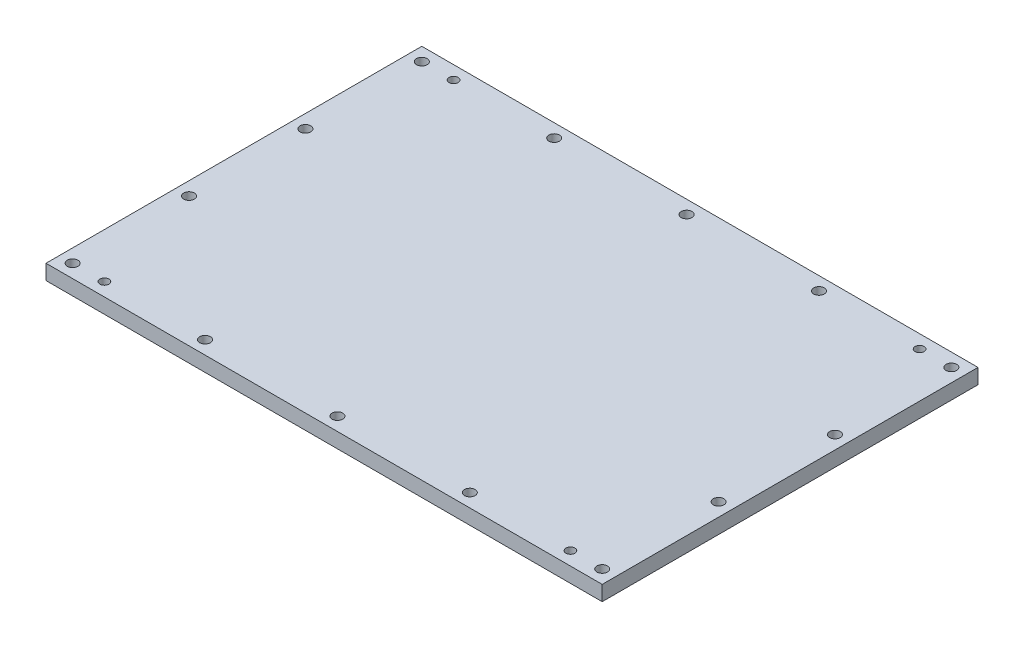
ISO-10303-21;
HEADER;
FILE_DESCRIPTION(('STEP AP214'),'2;1');
FILE_NAME('part.step','',(''),(''),'','','');
FILE_SCHEMA(('AUTOMOTIVE_DESIGN { 1 0 10303 214 1 1 1 1 }'));
ENDSEC;
DATA;
#1=APPLICATION_CONTEXT('core data for automotive mechanical design processes');
#2=APPLICATION_PROTOCOL_DEFINITION('international standard','automotive_design',2000,#1);
#3=PRODUCT_CONTEXT('',#1,'mechanical');
#4=PRODUCT('Part','Part','',(#3));
#5=PRODUCT_RELATED_PRODUCT_CATEGORY('part','',(#4));
#6=PRODUCT_DEFINITION_FORMATION('','',#4);
#7=PRODUCT_DEFINITION_CONTEXT('part definition',#1,'design');
#8=PRODUCT_DEFINITION('design','',#6,#7);
#9=PRODUCT_DEFINITION_SHAPE('','',#8);
#10=(LENGTH_UNIT() NAMED_UNIT(*) SI_UNIT(.MILLI.,.METRE.));
#11=(NAMED_UNIT(*) PLANE_ANGLE_UNIT() SI_UNIT($,.RADIAN.));
#12=(NAMED_UNIT(*) SI_UNIT($,.STERADIAN.) SOLID_ANGLE_UNIT());
#13=UNCERTAINTY_MEASURE_WITH_UNIT(LENGTH_MEASURE(1.E-05),#10,'distance_accuracy_value','');
#14=(GEOMETRIC_REPRESENTATION_CONTEXT(3) GLOBAL_UNCERTAINTY_ASSIGNED_CONTEXT((#13)) GLOBAL_UNIT_ASSIGNED_CONTEXT((#10,
#11,#12)) REPRESENTATION_CONTEXT('',''));
#15=CARTESIAN_POINT('',(0.,0.,0.));
#16=DIRECTION('',(0.,0.,1.));
#17=DIRECTION('',(1.,0.,0.));
#18=AXIS2_PLACEMENT_3D('',#15,#16,#17);
#19=CARTESIAN_POINT('',(-117.475,6.35,-79.375));
#20=DIRECTION('',(1.,0.,0.));
#21=DIRECTION('',(0.,0.,-1.));
#22=AXIS2_PLACEMENT_3D('',#19,#20,#21);
#23=PLANE('',#22);
#24=DIRECTION('',(0.,0.,1.));
#25=VECTOR('',#24,1.);
#26=CARTESIAN_POINT('',(-117.475,0.,-79.375));
#27=LINE('',#26,#25);
#28=CARTESIAN_POINT('',(-117.475,0.,-79.375));
#29=VERTEX_POINT('',#28);
#30=CARTESIAN_POINT('',(-117.475,0.,79.375));
#31=VERTEX_POINT('',#30);
#32=EDGE_CURVE('E98',#29,#31,#27,.T.);
#33=ORIENTED_EDGE('',*,*,#32,.T.);
#34=DIRECTION('',(0.,-1.,0.));
#35=VECTOR('',#34,1.);
#36=CARTESIAN_POINT('',(-117.475,6.35,79.375));
#37=LINE('',#36,#35);
#38=CARTESIAN_POINT('',(-117.475,6.35,79.375));
#39=VERTEX_POINT('',#38);
#40=EDGE_CURVE('E11',#39,#31,#37,.T.);
#41=ORIENTED_EDGE('',*,*,#40,.F.);
#42=DIRECTION('',(0.,0.,1.));
#43=VECTOR('',#42,1.);
#44=CARTESIAN_POINT('',(-117.475,6.35,-79.375));
#45=LINE('',#44,#43);
#46=CARTESIAN_POINT('',(-117.475,6.35,-79.375));
#47=VERTEX_POINT('',#46);
#48=EDGE_CURVE('E86',#47,#39,#45,.T.);
#49=ORIENTED_EDGE('',*,*,#48,.F.);
#50=DIRECTION('',(0.,-1.,0.));
#51=VECTOR('',#50,1.);
#52=CARTESIAN_POINT('',(-117.475,6.35,-79.375));
#53=LINE('',#52,#51);
#54=EDGE_CURVE('E94',#47,#29,#53,.T.);
#55=ORIENTED_EDGE('',*,*,#54,.T.);
#56=EDGE_LOOP('',(#33,#41,#49,#55));
#57=FACE_BOUND('',#56,.T.);
#58=ADVANCED_FACE('F35',(#57),#23,.F.);
#59=CARTESIAN_POINT('',(-117.475,6.35,79.375));
#60=DIRECTION('',(0.,0.,-1.));
#61=DIRECTION('',(-1.,0.,0.));
#62=AXIS2_PLACEMENT_3D('',#59,#60,#61);
#63=PLANE('',#62);
#64=DIRECTION('',(1.,0.,0.));
#65=VECTOR('',#64,1.);
#66=CARTESIAN_POINT('',(-117.475,0.,79.375));
#67=LINE('',#66,#65);
#68=CARTESIAN_POINT('',(117.475,0.,79.375));
#69=VERTEX_POINT('',#68);
#70=EDGE_CURVE('E90',#31,#69,#67,.T.);
#71=ORIENTED_EDGE('',*,*,#70,.T.);
#72=DIRECTION('',(0.,-1.,0.));
#73=VECTOR('',#72,1.);
#74=CARTESIAN_POINT('',(117.475,6.35,79.375));
#75=LINE('',#74,#73);
#76=CARTESIAN_POINT('',(117.475,6.35,79.375));
#77=VERTEX_POINT('',#76);
#78=EDGE_CURVE('E43',#77,#69,#75,.T.);
#79=ORIENTED_EDGE('',*,*,#78,.F.);
#80=DIRECTION('',(1.,0.,0.));
#81=VECTOR('',#80,1.);
#82=CARTESIAN_POINT('',(-117.475,6.35,79.375));
#83=LINE('',#82,#81);
#84=EDGE_CURVE('E81',#39,#77,#83,.T.);
#85=ORIENTED_EDGE('',*,*,#84,.F.);
#86=ORIENTED_EDGE('',*,*,#40,.T.);
#87=EDGE_LOOP('',(#71,#79,#85,#86));
#88=FACE_BOUND('',#87,.T.);
#89=ADVANCED_FACE('F89',(#88),#63,.F.);
#90=CARTESIAN_POINT('',(117.475,6.35,-79.375));
#91=DIRECTION('',(-1.,0.,0.));
#92=DIRECTION('',(0.,0.,1.));
#93=AXIS2_PLACEMENT_3D('',#90,#91,#92);
#94=PLANE('',#93);
#95=DIRECTION('',(0.,0.,-1.));
#96=VECTOR('',#95,1.);
#97=CARTESIAN_POINT('',(117.475,0.,-79.375));
#98=LINE('',#97,#96);
#99=CARTESIAN_POINT('',(117.475,0.,-79.375));
#100=VERTEX_POINT('',#99);
#101=EDGE_CURVE('E68',#69,#100,#98,.T.);
#102=ORIENTED_EDGE('',*,*,#101,.T.);
#103=DIRECTION('',(0.,-1.,0.));
#104=VECTOR('',#103,1.);
#105=CARTESIAN_POINT('',(117.475,6.35,-79.375));
#106=LINE('',#105,#104);
#107=CARTESIAN_POINT('',(117.475,6.35,-79.375));
#108=VERTEX_POINT('',#107);
#109=EDGE_CURVE('E91',#108,#100,#106,.T.);
#110=ORIENTED_EDGE('',*,*,#109,.F.);
#111=DIRECTION('',(0.,0.,-1.));
#112=VECTOR('',#111,1.);
#113=CARTESIAN_POINT('',(117.475,6.35,-79.375));
#114=LINE('',#113,#112);
#115=EDGE_CURVE('E84',#77,#108,#114,.T.);
#116=ORIENTED_EDGE('',*,*,#115,.F.);
#117=ORIENTED_EDGE('',*,*,#78,.T.);
#118=EDGE_LOOP('',(#102,#110,#116,#117));
#119=FACE_BOUND('',#118,.T.);
#120=ADVANCED_FACE('F92',(#119),#94,.F.);
#121=CARTESIAN_POINT('',(-117.475,6.35,-79.375));
#122=DIRECTION('',(0.,0.,1.));
#123=DIRECTION('',(1.,0.,0.));
#124=AXIS2_PLACEMENT_3D('',#121,#122,#123);
#125=PLANE('',#124);
#126=DIRECTION('',(-1.,0.,0.));
#127=VECTOR('',#126,1.);
#128=CARTESIAN_POINT('',(-117.475,0.,-79.375));
#129=LINE('',#128,#127);
#130=EDGE_CURVE('E74',#100,#29,#129,.T.);
#131=ORIENTED_EDGE('',*,*,#130,.T.);
#132=ORIENTED_EDGE('',*,*,#54,.F.);
#133=DIRECTION('',(-1.,0.,0.));
#134=VECTOR('',#133,1.);
#135=CARTESIAN_POINT('',(-117.475,6.35,-79.375));
#136=LINE('',#135,#134);
#137=EDGE_CURVE('E51',#108,#47,#136,.T.);
#138=ORIENTED_EDGE('',*,*,#137,.F.);
#139=ORIENTED_EDGE('',*,*,#109,.T.);
#140=EDGE_LOOP('',(#131,#132,#138,#139));
#141=FACE_BOUND('',#140,.T.);
#142=ADVANCED_FACE('F106',(#141),#125,.F.);
#143=CARTESIAN_POINT('',(0.,6.35,0.));
#144=DIRECTION('',(0.,1.,0.));
#145=DIRECTION('',(0.,0.,1.));
#146=AXIS2_PLACEMENT_3D('',#143,#144,#145);
#147=PLANE('',#146);
#148=CARTESIAN_POINT('',(-98.425,6.35,-73.7489));
#149=DIRECTION('',(0.,1.,0.));
#150=DIRECTION('',(0.,0.,1.));
#151=AXIS2_PLACEMENT_3D('',#148,#149,#150);
#152=CIRCLE('',#151,1.89864999999999);
#153=CARTESIAN_POINT('',(-98.425,6.35,-71.85025));
#154=VERTEX_POINT('',#153);
#155=EDGE_CURVE('E216',#154,#154,#152,.T.);
#156=ORIENTED_EDGE('',*,*,#155,.F.);
#157=EDGE_LOOP('',(#156));
#158=FACE_BOUND('',#157,.T.);
#159=CARTESIAN_POINT('',(-98.425,6.35,73.7489));
#160=DIRECTION('',(0.,1.,0.));
#161=DIRECTION('',(0.,0.,1.));
#162=AXIS2_PLACEMENT_3D('',#159,#160,#161);
#163=CIRCLE('',#162,1.89864999999999);
#164=CARTESIAN_POINT('',(-98.425,6.35,75.64755));
#165=VERTEX_POINT('',#164);
#166=EDGE_CURVE('E210',#165,#165,#163,.T.);
#167=ORIENTED_EDGE('',*,*,#166,.F.);
#168=EDGE_LOOP('',(#167));
#169=FACE_BOUND('',#168,.T.);
#170=CARTESIAN_POINT('',(98.425,6.35,-73.7489));
#171=DIRECTION('',(0.,1.,0.));
#172=DIRECTION('',(0.,0.,1.));
#173=AXIS2_PLACEMENT_3D('',#170,#171,#172);
#174=CIRCLE('',#173,1.89864999999999);
#175=CARTESIAN_POINT('',(98.425,6.35,-71.85025));
#176=VERTEX_POINT('',#175);
#177=EDGE_CURVE('E204',#176,#176,#174,.T.);
#178=ORIENTED_EDGE('',*,*,#177,.F.);
#179=EDGE_LOOP('',(#178));
#180=FACE_BOUND('',#179,.T.);
#181=CARTESIAN_POINT('',(98.425,6.35,73.7489));
#182=DIRECTION('',(0.,1.,0.));
#183=DIRECTION('',(0.,0.,1.));
#184=AXIS2_PLACEMENT_3D('',#181,#182,#183);
#185=CIRCLE('',#184,1.89864999999999);
#186=CARTESIAN_POINT('',(98.425,6.35,75.64755));
#187=VERTEX_POINT('',#186);
#188=EDGE_CURVE('E198',#187,#187,#185,.T.);
#189=ORIENTED_EDGE('',*,*,#188,.F.);
#190=EDGE_LOOP('',(#189));
#191=FACE_BOUND('',#190,.T.);
#192=CARTESIAN_POINT('',(0.,6.35,-73.7489));
#193=DIRECTION('',(0.,1.,0.));
#194=DIRECTION('',(0.,0.,1.));
#195=AXIS2_PLACEMENT_3D('',#192,#193,#194);
#196=CIRCLE('',#195,2.2479);
#197=CARTESIAN_POINT('',(0.,6.35,-71.501));
#198=VERTEX_POINT('',#197);
#199=EDGE_CURVE('E192',#198,#198,#196,.T.);
#200=ORIENTED_EDGE('',*,*,#199,.F.);
#201=EDGE_LOOP('',(#200));
#202=FACE_BOUND('',#201,.T.);
#203=CARTESIAN_POINT('',(-55.92445,6.35,-73.7489));
#204=DIRECTION('',(0.,1.,0.));
#205=DIRECTION('',(0.,0.,1.));
#206=AXIS2_PLACEMENT_3D('',#203,#204,#205);
#207=CIRCLE('',#206,2.2479);
#208=CARTESIAN_POINT('',(-55.92445,6.35,-71.501));
#209=VERTEX_POINT('',#208);
#210=EDGE_CURVE('E186',#209,#209,#207,.T.);
#211=ORIENTED_EDGE('',*,*,#210,.F.);
#212=EDGE_LOOP('',(#211));
#213=FACE_BOUND('',#212,.T.);
#214=CARTESIAN_POINT('',(-111.8489,6.35,-73.7489));
#215=DIRECTION('',(0.,1.,0.));
#216=DIRECTION('',(0.,0.,1.));
#217=AXIS2_PLACEMENT_3D('',#214,#215,#216);
#218=CIRCLE('',#217,2.2479);
#219=CARTESIAN_POINT('',(-111.8489,6.35,-71.501));
#220=VERTEX_POINT('',#219);
#221=EDGE_CURVE('E180',#220,#220,#218,.T.);
#222=ORIENTED_EDGE('',*,*,#221,.F.);
#223=EDGE_LOOP('',(#222));
#224=FACE_BOUND('',#223,.T.);
#225=CARTESIAN_POINT('',(-111.8489,6.35,-24.5829666666667));
#226=DIRECTION('',(0.,1.,0.));
#227=DIRECTION('',(0.,0.,1.));
#228=AXIS2_PLACEMENT_3D('',#225,#226,#227);
#229=CIRCLE('',#228,2.2479);
#230=CARTESIAN_POINT('',(-111.8489,6.35,-22.3350666666667));
#231=VERTEX_POINT('',#230);
#232=EDGE_CURVE('E174',#231,#231,#229,.T.);
#233=ORIENTED_EDGE('',*,*,#232,.F.);
#234=EDGE_LOOP('',(#233));
#235=FACE_BOUND('',#234,.T.);
#236=CARTESIAN_POINT('',(-111.8489,6.35,24.5829666666667));
#237=DIRECTION('',(0.,1.,0.));
#238=DIRECTION('',(0.,0.,1.));
#239=AXIS2_PLACEMENT_3D('',#236,#237,#238);
#240=CIRCLE('',#239,2.2479);
#241=CARTESIAN_POINT('',(-111.8489,6.35,26.8308666666667));
#242=VERTEX_POINT('',#241);
#243=EDGE_CURVE('E168',#242,#242,#240,.T.);
#244=ORIENTED_EDGE('',*,*,#243,.F.);
#245=EDGE_LOOP('',(#244));
#246=FACE_BOUND('',#245,.T.);
#247=CARTESIAN_POINT('',(-111.8489,6.35,73.7489));
#248=DIRECTION('',(0.,1.,0.));
#249=DIRECTION('',(0.,0.,1.));
#250=AXIS2_PLACEMENT_3D('',#247,#248,#249);
#251=CIRCLE('',#250,2.2479);
#252=CARTESIAN_POINT('',(-111.8489,6.35,75.9968));
#253=VERTEX_POINT('',#252);
#254=EDGE_CURVE('E162',#253,#253,#251,.T.);
#255=ORIENTED_EDGE('',*,*,#254,.F.);
#256=EDGE_LOOP('',(#255));
#257=FACE_BOUND('',#256,.T.);
#258=CARTESIAN_POINT('',(111.8489,6.35,73.7489));
#259=DIRECTION('',(0.,1.,0.));
#260=DIRECTION('',(0.,0.,1.));
#261=AXIS2_PLACEMENT_3D('',#258,#259,#260);
#262=CIRCLE('',#261,2.2479);
#263=CARTESIAN_POINT('',(111.8489,6.35,75.9968));
#264=VERTEX_POINT('',#263);
#265=EDGE_CURVE('E156',#264,#264,#262,.T.);
#266=ORIENTED_EDGE('',*,*,#265,.F.);
#267=EDGE_LOOP('',(#266));
#268=FACE_BOUND('',#267,.T.);
#269=CARTESIAN_POINT('',(111.8489,6.35,24.5829666666667));
#270=DIRECTION('',(0.,1.,0.));
#271=DIRECTION('',(0.,0.,1.));
#272=AXIS2_PLACEMENT_3D('',#269,#270,#271);
#273=CIRCLE('',#272,2.2479);
#274=CARTESIAN_POINT('',(111.8489,6.35,26.8308666666667));
#275=VERTEX_POINT('',#274);
#276=EDGE_CURVE('E150',#275,#275,#273,.T.);
#277=ORIENTED_EDGE('',*,*,#276,.F.);
#278=EDGE_LOOP('',(#277));
#279=FACE_BOUND('',#278,.T.);
#280=CARTESIAN_POINT('',(111.8489,6.35,-24.5829666666667));
#281=DIRECTION('',(0.,1.,0.));
#282=DIRECTION('',(0.,0.,1.));
#283=AXIS2_PLACEMENT_3D('',#280,#281,#282);
#284=CIRCLE('',#283,2.2479);
#285=CARTESIAN_POINT('',(111.8489,6.35,-22.3350666666667));
#286=VERTEX_POINT('',#285);
#287=EDGE_CURVE('E144',#286,#286,#284,.T.);
#288=ORIENTED_EDGE('',*,*,#287,.F.);
#289=EDGE_LOOP('',(#288));
#290=FACE_BOUND('',#289,.T.);
#291=CARTESIAN_POINT('',(55.92445,6.35,-73.7489));
#292=DIRECTION('',(0.,1.,0.));
#293=DIRECTION('',(0.,0.,1.));
#294=AXIS2_PLACEMENT_3D('',#291,#292,#293);
#295=CIRCLE('',#294,2.2479);
#296=CARTESIAN_POINT('',(55.92445,6.35,-71.501));
#297=VERTEX_POINT('',#296);
#298=EDGE_CURVE('E138',#297,#297,#295,.T.);
#299=ORIENTED_EDGE('',*,*,#298,.F.);
#300=EDGE_LOOP('',(#299));
#301=FACE_BOUND('',#300,.T.);
#302=CARTESIAN_POINT('',(111.8489,6.35,-73.7489));
#303=DIRECTION('',(0.,1.,0.));
#304=DIRECTION('',(0.,0.,1.));
#305=AXIS2_PLACEMENT_3D('',#302,#303,#304);
#306=CIRCLE('',#305,2.2479);
#307=CARTESIAN_POINT('',(111.8489,6.35,-71.501));
#308=VERTEX_POINT('',#307);
#309=EDGE_CURVE('E132',#308,#308,#306,.T.);
#310=ORIENTED_EDGE('',*,*,#309,.F.);
#311=EDGE_LOOP('',(#310));
#312=FACE_BOUND('',#311,.T.);
#313=CARTESIAN_POINT('',(55.92445,6.35,73.7489));
#314=DIRECTION('',(0.,1.,0.));
#315=DIRECTION('',(0.,0.,1.));
#316=AXIS2_PLACEMENT_3D('',#313,#314,#315);
#317=CIRCLE('',#316,2.2479);
#318=CARTESIAN_POINT('',(55.92445,6.35,75.9968));
#319=VERTEX_POINT('',#318);
#320=EDGE_CURVE('E126',#319,#319,#317,.T.);
#321=ORIENTED_EDGE('',*,*,#320,.F.);
#322=EDGE_LOOP('',(#321));
#323=FACE_BOUND('',#322,.T.);
#324=CARTESIAN_POINT('',(0.,6.35,73.7489));
#325=DIRECTION('',(0.,1.,0.));
#326=DIRECTION('',(0.,0.,1.));
#327=AXIS2_PLACEMENT_3D('',#324,#325,#326);
#328=CIRCLE('',#327,2.2479);
#329=CARTESIAN_POINT('',(0.,6.35,75.9968));
#330=VERTEX_POINT('',#329);
#331=EDGE_CURVE('E120',#330,#330,#328,.T.);
#332=ORIENTED_EDGE('',*,*,#331,.F.);
#333=EDGE_LOOP('',(#332));
#334=FACE_BOUND('',#333,.T.);
#335=CARTESIAN_POINT('',(-55.92445,6.35,73.7489));
#336=DIRECTION('',(0.,1.,0.));
#337=DIRECTION('',(0.,0.,1.));
#338=AXIS2_PLACEMENT_3D('',#335,#336,#337);
#339=CIRCLE('',#338,2.2479);
#340=CARTESIAN_POINT('',(-55.92445,6.35,75.9968));
#341=VERTEX_POINT('',#340);
#342=EDGE_CURVE('E114',#341,#341,#339,.T.);
#343=ORIENTED_EDGE('',*,*,#342,.F.);
#344=EDGE_LOOP('',(#343));
#345=FACE_BOUND('',#344,.T.);
#346=ORIENTED_EDGE('',*,*,#48,.T.);
#347=ORIENTED_EDGE('',*,*,#84,.T.);
#348=ORIENTED_EDGE('',*,*,#115,.T.);
#349=ORIENTED_EDGE('',*,*,#137,.T.);
#350=EDGE_LOOP('',(#346,#347,#348,#349));
#351=FACE_BOUND('',#350,.T.);
#352=ADVANCED_FACE('F82',(#158,#169,#180,#191,#202,#213,#224,#235,#246,#257,#268,#279,#290,#301,
#312,#323,#334,#345,#351),#147,.T.);
#353=CARTESIAN_POINT('',(0.,0.,0.));
#354=DIRECTION('',(0.,1.,0.));
#355=DIRECTION('',(0.,0.,1.));
#356=AXIS2_PLACEMENT_3D('',#353,#354,#355);
#357=PLANE('',#356);
#358=CARTESIAN_POINT('',(-98.425,0.,-73.7489));
#359=DIRECTION('',(0.,1.,0.));
#360=DIRECTION('',(0.,0.,1.));
#361=AXIS2_PLACEMENT_3D('',#358,#359,#360);
#362=CIRCLE('',#361,1.89864999999999);
#363=CARTESIAN_POINT('',(-98.425,0.,-71.85025));
#364=VERTEX_POINT('',#363);
#365=EDGE_CURVE('E213',#364,#364,#362,.T.);
#366=ORIENTED_EDGE('',*,*,#365,.T.);
#367=EDGE_LOOP('',(#366));
#368=FACE_BOUND('',#367,.T.);
#369=CARTESIAN_POINT('',(-98.425,0.,73.7489));
#370=DIRECTION('',(0.,1.,0.));
#371=DIRECTION('',(0.,0.,1.));
#372=AXIS2_PLACEMENT_3D('',#369,#370,#371);
#373=CIRCLE('',#372,1.89864999999999);
#374=CARTESIAN_POINT('',(-98.425,0.,75.64755));
#375=VERTEX_POINT('',#374);
#376=EDGE_CURVE('E207',#375,#375,#373,.T.);
#377=ORIENTED_EDGE('',*,*,#376,.T.);
#378=EDGE_LOOP('',(#377));
#379=FACE_BOUND('',#378,.T.);
#380=CARTESIAN_POINT('',(98.425,0.,-73.7489));
#381=DIRECTION('',(0.,1.,0.));
#382=DIRECTION('',(0.,0.,1.));
#383=AXIS2_PLACEMENT_3D('',#380,#381,#382);
#384=CIRCLE('',#383,1.89864999999999);
#385=CARTESIAN_POINT('',(98.425,0.,-71.85025));
#386=VERTEX_POINT('',#385);
#387=EDGE_CURVE('E201',#386,#386,#384,.T.);
#388=ORIENTED_EDGE('',*,*,#387,.T.);
#389=EDGE_LOOP('',(#388));
#390=FACE_BOUND('',#389,.T.);
#391=CARTESIAN_POINT('',(98.425,0.,73.7489));
#392=DIRECTION('',(0.,1.,0.));
#393=DIRECTION('',(0.,0.,1.));
#394=AXIS2_PLACEMENT_3D('',#391,#392,#393);
#395=CIRCLE('',#394,1.89864999999999);
#396=CARTESIAN_POINT('',(98.425,0.,75.64755));
#397=VERTEX_POINT('',#396);
#398=EDGE_CURVE('E195',#397,#397,#395,.T.);
#399=ORIENTED_EDGE('',*,*,#398,.T.);
#400=EDGE_LOOP('',(#399));
#401=FACE_BOUND('',#400,.T.);
#402=CARTESIAN_POINT('',(0.,0.,-73.7489));
#403=DIRECTION('',(0.,1.,0.));
#404=DIRECTION('',(0.,0.,1.));
#405=AXIS2_PLACEMENT_3D('',#402,#403,#404);
#406=CIRCLE('',#405,2.2479);
#407=CARTESIAN_POINT('',(0.,0.,-71.501));
#408=VERTEX_POINT('',#407);
#409=EDGE_CURVE('E189',#408,#408,#406,.T.);
#410=ORIENTED_EDGE('',*,*,#409,.T.);
#411=EDGE_LOOP('',(#410));
#412=FACE_BOUND('',#411,.T.);
#413=CARTESIAN_POINT('',(-55.92445,0.,-73.7489));
#414=DIRECTION('',(0.,1.,0.));
#415=DIRECTION('',(0.,0.,1.));
#416=AXIS2_PLACEMENT_3D('',#413,#414,#415);
#417=CIRCLE('',#416,2.2479);
#418=CARTESIAN_POINT('',(-55.92445,0.,-71.501));
#419=VERTEX_POINT('',#418);
#420=EDGE_CURVE('E183',#419,#419,#417,.T.);
#421=ORIENTED_EDGE('',*,*,#420,.T.);
#422=EDGE_LOOP('',(#421));
#423=FACE_BOUND('',#422,.T.);
#424=CARTESIAN_POINT('',(-111.8489,0.,-73.7489));
#425=DIRECTION('',(0.,1.,0.));
#426=DIRECTION('',(0.,0.,1.));
#427=AXIS2_PLACEMENT_3D('',#424,#425,#426);
#428=CIRCLE('',#427,2.2479);
#429=CARTESIAN_POINT('',(-111.8489,0.,-71.501));
#430=VERTEX_POINT('',#429);
#431=EDGE_CURVE('E177',#430,#430,#428,.T.);
#432=ORIENTED_EDGE('',*,*,#431,.T.);
#433=EDGE_LOOP('',(#432));
#434=FACE_BOUND('',#433,.T.);
#435=CARTESIAN_POINT('',(-111.8489,0.,-24.5829666666667));
#436=DIRECTION('',(0.,1.,0.));
#437=DIRECTION('',(0.,0.,1.));
#438=AXIS2_PLACEMENT_3D('',#435,#436,#437);
#439=CIRCLE('',#438,2.2479);
#440=CARTESIAN_POINT('',(-111.8489,0.,-22.3350666666667));
#441=VERTEX_POINT('',#440);
#442=EDGE_CURVE('E171',#441,#441,#439,.T.);
#443=ORIENTED_EDGE('',*,*,#442,.T.);
#444=EDGE_LOOP('',(#443));
#445=FACE_BOUND('',#444,.T.);
#446=CARTESIAN_POINT('',(-111.8489,0.,24.5829666666667));
#447=DIRECTION('',(0.,1.,0.));
#448=DIRECTION('',(0.,0.,1.));
#449=AXIS2_PLACEMENT_3D('',#446,#447,#448);
#450=CIRCLE('',#449,2.2479);
#451=CARTESIAN_POINT('',(-111.8489,0.,26.8308666666667));
#452=VERTEX_POINT('',#451);
#453=EDGE_CURVE('E165',#452,#452,#450,.T.);
#454=ORIENTED_EDGE('',*,*,#453,.T.);
#455=EDGE_LOOP('',(#454));
#456=FACE_BOUND('',#455,.T.);
#457=CARTESIAN_POINT('',(-111.8489,0.,73.7489));
#458=DIRECTION('',(0.,1.,0.));
#459=DIRECTION('',(0.,0.,1.));
#460=AXIS2_PLACEMENT_3D('',#457,#458,#459);
#461=CIRCLE('',#460,2.2479);
#462=CARTESIAN_POINT('',(-111.8489,0.,75.9968));
#463=VERTEX_POINT('',#462);
#464=EDGE_CURVE('E159',#463,#463,#461,.T.);
#465=ORIENTED_EDGE('',*,*,#464,.T.);
#466=EDGE_LOOP('',(#465));
#467=FACE_BOUND('',#466,.T.);
#468=CARTESIAN_POINT('',(111.8489,0.,73.7489));
#469=DIRECTION('',(0.,1.,0.));
#470=DIRECTION('',(0.,0.,1.));
#471=AXIS2_PLACEMENT_3D('',#468,#469,#470);
#472=CIRCLE('',#471,2.2479);
#473=CARTESIAN_POINT('',(111.8489,0.,75.9968));
#474=VERTEX_POINT('',#473);
#475=EDGE_CURVE('E153',#474,#474,#472,.T.);
#476=ORIENTED_EDGE('',*,*,#475,.T.);
#477=EDGE_LOOP('',(#476));
#478=FACE_BOUND('',#477,.T.);
#479=CARTESIAN_POINT('',(111.8489,0.,24.5829666666667));
#480=DIRECTION('',(0.,1.,0.));
#481=DIRECTION('',(0.,0.,1.));
#482=AXIS2_PLACEMENT_3D('',#479,#480,#481);
#483=CIRCLE('',#482,2.2479);
#484=CARTESIAN_POINT('',(111.8489,0.,26.8308666666667));
#485=VERTEX_POINT('',#484);
#486=EDGE_CURVE('E147',#485,#485,#483,.T.);
#487=ORIENTED_EDGE('',*,*,#486,.T.);
#488=EDGE_LOOP('',(#487));
#489=FACE_BOUND('',#488,.T.);
#490=CARTESIAN_POINT('',(111.8489,0.,-24.5829666666667));
#491=DIRECTION('',(0.,1.,0.));
#492=DIRECTION('',(0.,0.,1.));
#493=AXIS2_PLACEMENT_3D('',#490,#491,#492);
#494=CIRCLE('',#493,2.2479);
#495=CARTESIAN_POINT('',(111.8489,0.,-22.3350666666667));
#496=VERTEX_POINT('',#495);
#497=EDGE_CURVE('E141',#496,#496,#494,.T.);
#498=ORIENTED_EDGE('',*,*,#497,.T.);
#499=EDGE_LOOP('',(#498));
#500=FACE_BOUND('',#499,.T.);
#501=CARTESIAN_POINT('',(55.92445,0.,-73.7489));
#502=DIRECTION('',(0.,1.,0.));
#503=DIRECTION('',(0.,0.,1.));
#504=AXIS2_PLACEMENT_3D('',#501,#502,#503);
#505=CIRCLE('',#504,2.2479);
#506=CARTESIAN_POINT('',(55.92445,0.,-71.501));
#507=VERTEX_POINT('',#506);
#508=EDGE_CURVE('E135',#507,#507,#505,.T.);
#509=ORIENTED_EDGE('',*,*,#508,.T.);
#510=EDGE_LOOP('',(#509));
#511=FACE_BOUND('',#510,.T.);
#512=CARTESIAN_POINT('',(111.8489,0.,-73.7489));
#513=DIRECTION('',(0.,1.,0.));
#514=DIRECTION('',(0.,0.,1.));
#515=AXIS2_PLACEMENT_3D('',#512,#513,#514);
#516=CIRCLE('',#515,2.2479);
#517=CARTESIAN_POINT('',(111.8489,0.,-71.501));
#518=VERTEX_POINT('',#517);
#519=EDGE_CURVE('E129',#518,#518,#516,.T.);
#520=ORIENTED_EDGE('',*,*,#519,.T.);
#521=EDGE_LOOP('',(#520));
#522=FACE_BOUND('',#521,.T.);
#523=CARTESIAN_POINT('',(55.92445,0.,73.7489));
#524=DIRECTION('',(0.,1.,0.));
#525=DIRECTION('',(0.,0.,1.));
#526=AXIS2_PLACEMENT_3D('',#523,#524,#525);
#527=CIRCLE('',#526,2.2479);
#528=CARTESIAN_POINT('',(55.92445,0.,75.9968));
#529=VERTEX_POINT('',#528);
#530=EDGE_CURVE('E123',#529,#529,#527,.T.);
#531=ORIENTED_EDGE('',*,*,#530,.T.);
#532=EDGE_LOOP('',(#531));
#533=FACE_BOUND('',#532,.T.);
#534=CARTESIAN_POINT('',(0.,0.,73.7489));
#535=DIRECTION('',(0.,1.,0.));
#536=DIRECTION('',(0.,0.,1.));
#537=AXIS2_PLACEMENT_3D('',#534,#535,#536);
#538=CIRCLE('',#537,2.2479);
#539=CARTESIAN_POINT('',(0.,0.,75.9968));
#540=VERTEX_POINT('',#539);
#541=EDGE_CURVE('E117',#540,#540,#538,.T.);
#542=ORIENTED_EDGE('',*,*,#541,.T.);
#543=EDGE_LOOP('',(#542));
#544=FACE_BOUND('',#543,.T.);
#545=CARTESIAN_POINT('',(-55.92445,0.,73.7489));
#546=DIRECTION('',(0.,1.,0.));
#547=DIRECTION('',(0.,0.,1.));
#548=AXIS2_PLACEMENT_3D('',#545,#546,#547);
#549=CIRCLE('',#548,2.2479);
#550=CARTESIAN_POINT('',(-55.92445,0.,75.9968));
#551=VERTEX_POINT('',#550);
#552=EDGE_CURVE('E101',#551,#551,#549,.T.);
#553=ORIENTED_EDGE('',*,*,#552,.T.);
#554=EDGE_LOOP('',(#553));
#555=FACE_BOUND('',#554,.T.);
#556=ORIENTED_EDGE('',*,*,#32,.F.);
#557=ORIENTED_EDGE('',*,*,#130,.F.);
#558=ORIENTED_EDGE('',*,*,#101,.F.);
#559=ORIENTED_EDGE('',*,*,#70,.F.);
#560=EDGE_LOOP('',(#556,#557,#558,#559));
#561=FACE_BOUND('',#560,.T.);
#562=ADVANCED_FACE('F109',(#368,#379,#390,#401,#412,#423,#434,#445,#456,#467,#478,#489,#500,
#511,#522,#533,#544,#555,#561),#357,.F.);
#563=CARTESIAN_POINT('',(-55.92445,6.35,73.7489));
#564=DIRECTION('',(0.,1.,0.));
#565=DIRECTION('',(0.,0.,1.));
#566=AXIS2_PLACEMENT_3D('',#563,#564,#565);
#567=CYLINDRICAL_SURFACE('',#566,2.2479);
#568=ORIENTED_EDGE('',*,*,#552,.F.);
#569=EDGE_LOOP('',(#568));
#570=FACE_BOUND('',#569,.T.);
#571=ORIENTED_EDGE('',*,*,#342,.T.);
#572=EDGE_LOOP('',(#571));
#573=FACE_BOUND('',#572,.T.);
#574=ADVANCED_FACE('F259',(#570,#573),#567,.F.);
#575=CARTESIAN_POINT('',(0.,6.35,73.7489));
#576=DIRECTION('',(0.,1.,0.));
#577=DIRECTION('',(0.,0.,1.));
#578=AXIS2_PLACEMENT_3D('',#575,#576,#577);
#579=CYLINDRICAL_SURFACE('',#578,2.2479);
#580=ORIENTED_EDGE('',*,*,#541,.F.);
#581=EDGE_LOOP('',(#580));
#582=FACE_BOUND('',#581,.T.);
#583=ORIENTED_EDGE('',*,*,#331,.T.);
#584=EDGE_LOOP('',(#583));
#585=FACE_BOUND('',#584,.T.);
#586=ADVANCED_FACE('F261',(#582,#585),#579,.F.);
#587=CARTESIAN_POINT('',(55.92445,6.35,73.7489));
#588=DIRECTION('',(0.,1.,0.));
#589=DIRECTION('',(0.,0.,1.));
#590=AXIS2_PLACEMENT_3D('',#587,#588,#589);
#591=CYLINDRICAL_SURFACE('',#590,2.2479);
#592=ORIENTED_EDGE('',*,*,#530,.F.);
#593=EDGE_LOOP('',(#592));
#594=FACE_BOUND('',#593,.T.);
#595=ORIENTED_EDGE('',*,*,#320,.T.);
#596=EDGE_LOOP('',(#595));
#597=FACE_BOUND('',#596,.T.);
#598=ADVANCED_FACE('F268',(#594,#597),#591,.F.);
#599=CARTESIAN_POINT('',(111.8489,6.35,-73.7489));
#600=DIRECTION('',(0.,1.,0.));
#601=DIRECTION('',(0.,0.,1.));
#602=AXIS2_PLACEMENT_3D('',#599,#600,#601);
#603=CYLINDRICAL_SURFACE('',#602,2.2479);
#604=ORIENTED_EDGE('',*,*,#519,.F.);
#605=EDGE_LOOP('',(#604));
#606=FACE_BOUND('',#605,.T.);
#607=ORIENTED_EDGE('',*,*,#309,.T.);
#608=EDGE_LOOP('',(#607));
#609=FACE_BOUND('',#608,.T.);
#610=ADVANCED_FACE('F383',(#606,#609),#603,.F.);
#611=CARTESIAN_POINT('',(55.92445,6.35,-73.7489));
#612=DIRECTION('',(0.,1.,0.));
#613=DIRECTION('',(0.,0.,1.));
#614=AXIS2_PLACEMENT_3D('',#611,#612,#613);
#615=CYLINDRICAL_SURFACE('',#614,2.2479);
#616=ORIENTED_EDGE('',*,*,#508,.F.);
#617=EDGE_LOOP('',(#616));
#618=FACE_BOUND('',#617,.T.);
#619=ORIENTED_EDGE('',*,*,#298,.T.);
#620=EDGE_LOOP('',(#619));
#621=FACE_BOUND('',#620,.T.);
#622=ADVANCED_FACE('F379',(#618,#621),#615,.F.);
#623=CARTESIAN_POINT('',(111.8489,6.35,-24.5829666666667));
#624=DIRECTION('',(0.,1.,0.));
#625=DIRECTION('',(0.,0.,1.));
#626=AXIS2_PLACEMENT_3D('',#623,#624,#625);
#627=CYLINDRICAL_SURFACE('',#626,2.2479);
#628=ORIENTED_EDGE('',*,*,#497,.F.);
#629=EDGE_LOOP('',(#628));
#630=FACE_BOUND('',#629,.T.);
#631=ORIENTED_EDGE('',*,*,#287,.T.);
#632=EDGE_LOOP('',(#631));
#633=FACE_BOUND('',#632,.T.);
#634=ADVANCED_FACE('F375',(#630,#633),#627,.F.);
#635=CARTESIAN_POINT('',(111.8489,6.35,24.5829666666667));
#636=DIRECTION('',(0.,1.,0.));
#637=DIRECTION('',(0.,0.,1.));
#638=AXIS2_PLACEMENT_3D('',#635,#636,#637);
#639=CYLINDRICAL_SURFACE('',#638,2.2479);
#640=ORIENTED_EDGE('',*,*,#486,.F.);
#641=EDGE_LOOP('',(#640));
#642=FACE_BOUND('',#641,.T.);
#643=ORIENTED_EDGE('',*,*,#276,.T.);
#644=EDGE_LOOP('',(#643));
#645=FACE_BOUND('',#644,.T.);
#646=ADVANCED_FACE('F371',(#642,#645),#639,.F.);
#647=CARTESIAN_POINT('',(111.8489,6.35,73.7489));
#648=DIRECTION('',(0.,1.,0.));
#649=DIRECTION('',(0.,0.,1.));
#650=AXIS2_PLACEMENT_3D('',#647,#648,#649);
#651=CYLINDRICAL_SURFACE('',#650,2.2479);
#652=ORIENTED_EDGE('',*,*,#475,.F.);
#653=EDGE_LOOP('',(#652));
#654=FACE_BOUND('',#653,.T.);
#655=ORIENTED_EDGE('',*,*,#265,.T.);
#656=EDGE_LOOP('',(#655));
#657=FACE_BOUND('',#656,.T.);
#658=ADVANCED_FACE('F367',(#654,#657),#651,.F.);
#659=CARTESIAN_POINT('',(-111.8489,6.35,73.7489));
#660=DIRECTION('',(0.,1.,0.));
#661=DIRECTION('',(0.,0.,1.));
#662=AXIS2_PLACEMENT_3D('',#659,#660,#661);
#663=CYLINDRICAL_SURFACE('',#662,2.2479);
#664=ORIENTED_EDGE('',*,*,#464,.F.);
#665=EDGE_LOOP('',(#664));
#666=FACE_BOUND('',#665,.T.);
#667=ORIENTED_EDGE('',*,*,#254,.T.);
#668=EDGE_LOOP('',(#667));
#669=FACE_BOUND('',#668,.T.);
#670=ADVANCED_FACE('F363',(#666,#669),#663,.F.);
#671=CARTESIAN_POINT('',(-111.8489,6.35,24.5829666666667));
#672=DIRECTION('',(0.,1.,0.));
#673=DIRECTION('',(0.,0.,1.));
#674=AXIS2_PLACEMENT_3D('',#671,#672,#673);
#675=CYLINDRICAL_SURFACE('',#674,2.2479);
#676=ORIENTED_EDGE('',*,*,#453,.F.);
#677=EDGE_LOOP('',(#676));
#678=FACE_BOUND('',#677,.T.);
#679=ORIENTED_EDGE('',*,*,#243,.T.);
#680=EDGE_LOOP('',(#679));
#681=FACE_BOUND('',#680,.T.);
#682=ADVANCED_FACE('F359',(#678,#681),#675,.F.);
#683=CARTESIAN_POINT('',(-111.8489,6.35,-24.5829666666667));
#684=DIRECTION('',(0.,1.,0.));
#685=DIRECTION('',(0.,0.,1.));
#686=AXIS2_PLACEMENT_3D('',#683,#684,#685);
#687=CYLINDRICAL_SURFACE('',#686,2.2479);
#688=ORIENTED_EDGE('',*,*,#442,.F.);
#689=EDGE_LOOP('',(#688));
#690=FACE_BOUND('',#689,.T.);
#691=ORIENTED_EDGE('',*,*,#232,.T.);
#692=EDGE_LOOP('',(#691));
#693=FACE_BOUND('',#692,.T.);
#694=ADVANCED_FACE('F355',(#690,#693),#687,.F.);
#695=CARTESIAN_POINT('',(-111.8489,6.35,-73.7489));
#696=DIRECTION('',(0.,1.,0.));
#697=DIRECTION('',(0.,0.,1.));
#698=AXIS2_PLACEMENT_3D('',#695,#696,#697);
#699=CYLINDRICAL_SURFACE('',#698,2.2479);
#700=ORIENTED_EDGE('',*,*,#431,.F.);
#701=EDGE_LOOP('',(#700));
#702=FACE_BOUND('',#701,.T.);
#703=ORIENTED_EDGE('',*,*,#221,.T.);
#704=EDGE_LOOP('',(#703));
#705=FACE_BOUND('',#704,.T.);
#706=ADVANCED_FACE('F351',(#702,#705),#699,.F.);
#707=CARTESIAN_POINT('',(-55.92445,6.35,-73.7489));
#708=DIRECTION('',(0.,1.,0.));
#709=DIRECTION('',(0.,0.,1.));
#710=AXIS2_PLACEMENT_3D('',#707,#708,#709);
#711=CYLINDRICAL_SURFACE('',#710,2.2479);
#712=ORIENTED_EDGE('',*,*,#420,.F.);
#713=EDGE_LOOP('',(#712));
#714=FACE_BOUND('',#713,.T.);
#715=ORIENTED_EDGE('',*,*,#210,.T.);
#716=EDGE_LOOP('',(#715));
#717=FACE_BOUND('',#716,.T.);
#718=ADVANCED_FACE('F347',(#714,#717),#711,.F.);
#719=CARTESIAN_POINT('',(0.,6.35,-73.7489));
#720=DIRECTION('',(0.,1.,0.));
#721=DIRECTION('',(0.,0.,1.));
#722=AXIS2_PLACEMENT_3D('',#719,#720,#721);
#723=CYLINDRICAL_SURFACE('',#722,2.2479);
#724=ORIENTED_EDGE('',*,*,#409,.F.);
#725=EDGE_LOOP('',(#724));
#726=FACE_BOUND('',#725,.T.);
#727=ORIENTED_EDGE('',*,*,#199,.T.);
#728=EDGE_LOOP('',(#727));
#729=FACE_BOUND('',#728,.T.);
#730=ADVANCED_FACE('F309',(#726,#729),#723,.F.);
#731=CARTESIAN_POINT('',(98.425,6.35,73.7489));
#732=DIRECTION('',(0.,1.,0.));
#733=DIRECTION('',(0.,0.,1.));
#734=AXIS2_PLACEMENT_3D('',#731,#732,#733);
#735=CYLINDRICAL_SURFACE('',#734,1.89864999999999);
#736=ORIENTED_EDGE('',*,*,#398,.F.);
#737=EDGE_LOOP('',(#736));
#738=FACE_BOUND('',#737,.T.);
#739=ORIENTED_EDGE('',*,*,#188,.T.);
#740=EDGE_LOOP('',(#739));
#741=FACE_BOUND('',#740,.T.);
#742=ADVANCED_FACE('F303',(#738,#741),#735,.F.);
#743=CARTESIAN_POINT('',(98.425,6.35,-73.7489));
#744=DIRECTION('',(0.,1.,0.));
#745=DIRECTION('',(0.,0.,1.));
#746=AXIS2_PLACEMENT_3D('',#743,#744,#745);
#747=CYLINDRICAL_SURFACE('',#746,1.89864999999999);
#748=ORIENTED_EDGE('',*,*,#387,.F.);
#749=EDGE_LOOP('',(#748));
#750=FACE_BOUND('',#749,.T.);
#751=ORIENTED_EDGE('',*,*,#177,.T.);
#752=EDGE_LOOP('',(#751));
#753=FACE_BOUND('',#752,.T.);
#754=ADVANCED_FACE('F308',(#750,#753),#747,.F.);
#755=CARTESIAN_POINT('',(-98.425,6.35,73.7489));
#756=DIRECTION('',(0.,1.,0.));
#757=DIRECTION('',(0.,0.,1.));
#758=AXIS2_PLACEMENT_3D('',#755,#756,#757);
#759=CYLINDRICAL_SURFACE('',#758,1.89864999999999);
#760=ORIENTED_EDGE('',*,*,#376,.F.);
#761=EDGE_LOOP('',(#760));
#762=FACE_BOUND('',#761,.T.);
#763=ORIENTED_EDGE('',*,*,#166,.T.);
#764=EDGE_LOOP('',(#763));
#765=FACE_BOUND('',#764,.T.);
#766=ADVANCED_FACE('F321',(#762,#765),#759,.F.);
#767=CARTESIAN_POINT('',(-98.425,6.35,-73.7489));
#768=DIRECTION('',(0.,1.,0.));
#769=DIRECTION('',(0.,0.,1.));
#770=AXIS2_PLACEMENT_3D('',#767,#768,#769);
#771=CYLINDRICAL_SURFACE('',#770,1.89864999999999);
#772=ORIENTED_EDGE('',*,*,#365,.F.);
#773=EDGE_LOOP('',(#772));
#774=FACE_BOUND('',#773,.T.);
#775=ORIENTED_EDGE('',*,*,#155,.T.);
#776=EDGE_LOOP('',(#775));
#777=FACE_BOUND('',#776,.T.);
#778=ADVANCED_FACE('F220',(#774,#777),#771,.F.);
#779=CLOSED_SHELL('',(#58,#89,#120,#142,#352,#562,#574,#586,#598,#610,#622,#634,#646,#658,#670,
#682,#694,#706,#718,#730,#742,#754,#766,#778));
#780=MANIFOLD_SOLID_BREP('B2',#779);
#781=ADVANCED_BREP_SHAPE_REPRESENTATION('',(#18,#780),#14);
#782=SHAPE_DEFINITION_REPRESENTATION(#9,#781);
ENDSEC;
END-ISO-10303-21;
